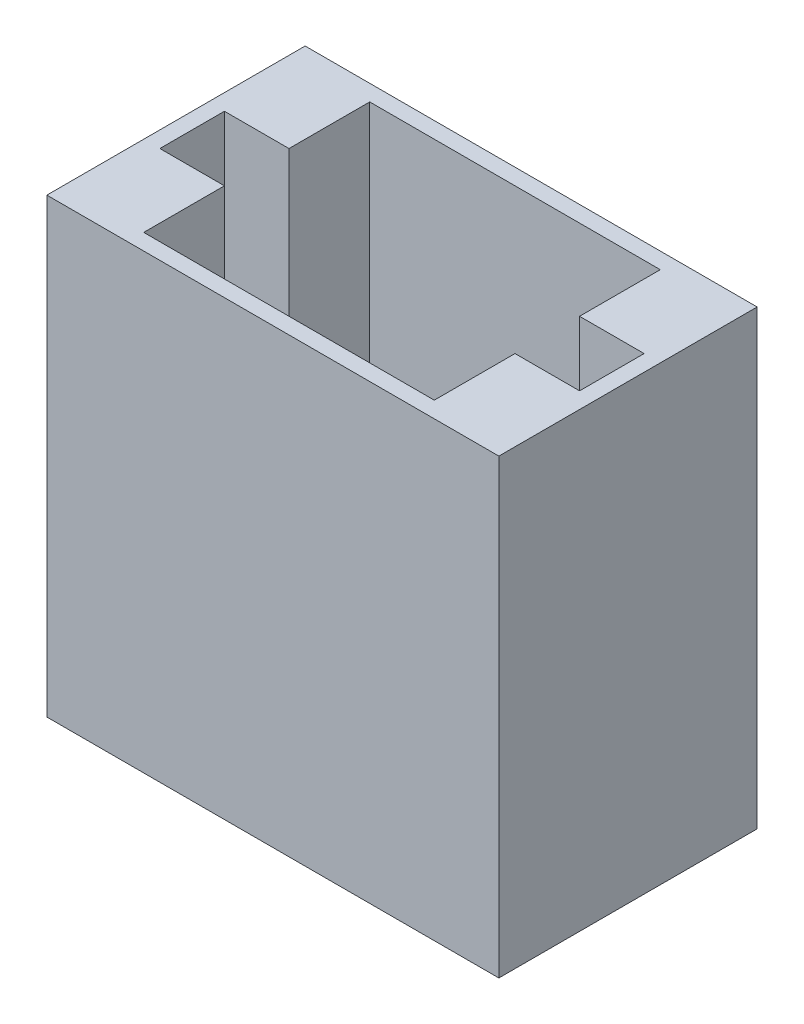
ISO-10303-21;
HEADER;
FILE_DESCRIPTION(('STEP AP214'),'2;1');
FILE_NAME('part.step','',(''),(''),'','','');
FILE_SCHEMA(('AUTOMOTIVE_DESIGN { 1 0 10303 214 1 1 1 1 }'));
ENDSEC;
DATA;
#1=APPLICATION_CONTEXT('core data for automotive mechanical design processes');
#2=APPLICATION_PROTOCOL_DEFINITION('international standard','automotive_design',2000,#1);
#3=PRODUCT_CONTEXT('',#1,'mechanical');
#4=PRODUCT('Part','Part','',(#3));
#5=PRODUCT_RELATED_PRODUCT_CATEGORY('part','',(#4));
#6=PRODUCT_DEFINITION_FORMATION('','',#4);
#7=PRODUCT_DEFINITION_CONTEXT('part definition',#1,'design');
#8=PRODUCT_DEFINITION('design','',#6,#7);
#9=PRODUCT_DEFINITION_SHAPE('','',#8);
#10=(LENGTH_UNIT() NAMED_UNIT(*) SI_UNIT(.MILLI.,.METRE.));
#11=(NAMED_UNIT(*) PLANE_ANGLE_UNIT() SI_UNIT($,.RADIAN.));
#12=(NAMED_UNIT(*) SI_UNIT($,.STERADIAN.) SOLID_ANGLE_UNIT());
#13=UNCERTAINTY_MEASURE_WITH_UNIT(LENGTH_MEASURE(1.E-05),#10,'distance_accuracy_value','');
#14=(GEOMETRIC_REPRESENTATION_CONTEXT(3) GLOBAL_UNCERTAINTY_ASSIGNED_CONTEXT((#13)) GLOBAL_UNIT_ASSIGNED_CONTEXT((#10,
#11,#12)) REPRESENTATION_CONTEXT('',''));
#15=CARTESIAN_POINT('',(0.,0.,0.));
#16=DIRECTION('',(0.,0.,1.));
#17=DIRECTION('',(1.,0.,0.));
#18=AXIS2_PLACEMENT_3D('',#15,#16,#17);
#19=CARTESIAN_POINT('',(32.5,0.,-17.5));
#20=DIRECTION('',(1.,0.,0.));
#21=DIRECTION('',(0.,0.,-1.));
#22=AXIS2_PLACEMENT_3D('',#19,#20,#21);
#23=PLANE('',#22);
#24=DIRECTION('',(0.,0.,-1.));
#25=VECTOR('',#24,1.);
#26=CARTESIAN_POINT('',(32.5,70.,-17.5));
#27=LINE('',#26,#25);
#28=CARTESIAN_POINT('',(32.5,70.,5.));
#29=VERTEX_POINT('',#28);
#30=CARTESIAN_POINT('',(32.5,70.,-5.));
#31=VERTEX_POINT('',#30);
#32=EDGE_CURVE('E182',#29,#31,#27,.T.);
#33=ORIENTED_EDGE('',*,*,#32,.T.);
#34=DIRECTION('',(0.,-1.,0.));
#35=VECTOR('',#34,1.);
#36=CARTESIAN_POINT('',(32.5,0.,-5.));
#37=LINE('',#36,#35);
#38=CARTESIAN_POINT('',(32.5,0.,-5.));
#39=VERTEX_POINT('',#38);
#40=EDGE_CURVE('E438',#31,#39,#37,.T.);
#41=ORIENTED_EDGE('',*,*,#40,.T.);
#42=DIRECTION('',(0.,0.,-1.));
#43=VECTOR('',#42,1.);
#44=CARTESIAN_POINT('',(32.5,0.,-17.5));
#45=LINE('',#44,#43);
#46=CARTESIAN_POINT('',(32.5,0.,5.));
#47=VERTEX_POINT('',#46);
#48=EDGE_CURVE('E171',#47,#39,#45,.T.);
#49=ORIENTED_EDGE('',*,*,#48,.F.);
#50=DIRECTION('',(0.,-1.,0.));
#51=VECTOR('',#50,1.);
#52=CARTESIAN_POINT('',(32.5,0.,5.));
#53=LINE('',#52,#51);
#54=EDGE_CURVE('E445',#29,#47,#53,.T.);
#55=ORIENTED_EDGE('',*,*,#54,.F.);
#56=EDGE_LOOP('',(#33,#41,#49,#55));
#57=FACE_BOUND('',#56,.T.);
#58=ADVANCED_FACE('F35',(#57),#23,.F.);
#59=CARTESIAN_POINT('',(-32.5,0.,-17.5));
#60=DIRECTION('',(-1.,0.,0.));
#61=DIRECTION('',(0.,0.,1.));
#62=AXIS2_PLACEMENT_3D('',#59,#60,#61);
#63=PLANE('',#62);
#64=DIRECTION('',(0.,-1.,0.));
#65=VECTOR('',#64,1.);
#66=CARTESIAN_POINT('',(-32.5,0.,-5.));
#67=LINE('',#66,#65);
#68=CARTESIAN_POINT('',(-32.5,70.,-5.));
#69=VERTEX_POINT('',#68);
#70=CARTESIAN_POINT('',(-32.5,0.,-5.));
#71=VERTEX_POINT('',#70);
#72=EDGE_CURVE('E464',#69,#71,#67,.T.);
#73=ORIENTED_EDGE('',*,*,#72,.F.);
#74=DIRECTION('',(0.,0.,1.));
#75=VECTOR('',#74,1.);
#76=CARTESIAN_POINT('',(-32.5,70.,-17.5));
#77=LINE('',#76,#75);
#78=CARTESIAN_POINT('',(-32.5,70.,5.));
#79=VERTEX_POINT('',#78);
#80=EDGE_CURVE('E188',#69,#79,#77,.T.);
#81=ORIENTED_EDGE('',*,*,#80,.T.);
#82=DIRECTION('',(0.,-1.,0.));
#83=VECTOR('',#82,1.);
#84=CARTESIAN_POINT('',(-32.5,0.,5.));
#85=LINE('',#84,#83);
#86=CARTESIAN_POINT('',(-32.5,0.,5.));
#87=VERTEX_POINT('',#86);
#88=EDGE_CURVE('E479',#79,#87,#85,.T.);
#89=ORIENTED_EDGE('',*,*,#88,.T.);
#90=DIRECTION('',(0.,0.,1.));
#91=VECTOR('',#90,1.);
#92=CARTESIAN_POINT('',(-32.5,0.,-17.5));
#93=LINE('',#92,#91);
#94=EDGE_CURVE('E170',#71,#87,#93,.T.);
#95=ORIENTED_EDGE('',*,*,#94,.F.);
#96=EDGE_LOOP('',(#73,#81,#89,#95));
#97=FACE_BOUND('',#96,.T.);
#98=ADVANCED_FACE('F240',(#97),#63,.F.);
#99=CARTESIAN_POINT('',(35.,70.,20.));
#100=DIRECTION('',(-1.,0.,0.));
#101=DIRECTION('',(0.,0.,1.));
#102=AXIS2_PLACEMENT_3D('',#99,#100,#101);
#103=PLANE('',#102);
#104=DIRECTION('',(0.,0.,-1.));
#105=VECTOR('',#104,1.);
#106=CARTESIAN_POINT('',(35.,0.,20.));
#107=LINE('',#106,#105);
#108=CARTESIAN_POINT('',(35.,0.,20.));
#109=VERTEX_POINT('',#108);
#110=CARTESIAN_POINT('',(35.,0.,-20.));
#111=VERTEX_POINT('',#110);
#112=EDGE_CURVE('E181',#109,#111,#107,.T.);
#113=ORIENTED_EDGE('',*,*,#112,.T.);
#114=DIRECTION('',(0.,-1.,0.));
#115=VECTOR('',#114,1.);
#116=CARTESIAN_POINT('',(35.,70.,-20.));
#117=LINE('',#116,#115);
#118=CARTESIAN_POINT('',(35.,70.,-20.));
#119=VERTEX_POINT('',#118);
#120=EDGE_CURVE('E11',#119,#111,#117,.T.);
#121=ORIENTED_EDGE('',*,*,#120,.F.);
#122=DIRECTION('',(0.,0.,-1.));
#123=VECTOR('',#122,1.);
#124=CARTESIAN_POINT('',(35.,70.,20.));
#125=LINE('',#124,#123);
#126=CARTESIAN_POINT('',(35.,70.,20.));
#127=VERTEX_POINT('',#126);
#128=EDGE_CURVE('E192',#127,#119,#125,.T.);
#129=ORIENTED_EDGE('',*,*,#128,.F.);
#130=DIRECTION('',(0.,-1.,0.));
#131=VECTOR('',#130,1.);
#132=CARTESIAN_POINT('',(35.,70.,20.));
#133=LINE('',#132,#131);
#134=EDGE_CURVE('E202',#127,#109,#133,.T.);
#135=ORIENTED_EDGE('',*,*,#134,.T.);
#136=EDGE_LOOP('',(#113,#121,#129,#135));
#137=FACE_BOUND('',#136,.T.);
#138=ADVANCED_FACE('F37',(#137),#103,.F.);
#139=CARTESIAN_POINT('',(-35.,70.,-20.));
#140=DIRECTION('',(0.,0.,1.));
#141=DIRECTION('',(1.,0.,0.));
#142=AXIS2_PLACEMENT_3D('',#139,#140,#141);
#143=PLANE('',#142);
#144=DIRECTION('',(-1.,0.,0.));
#145=VECTOR('',#144,1.);
#146=CARTESIAN_POINT('',(-35.,0.,-20.));
#147=LINE('',#146,#145);
#148=CARTESIAN_POINT('',(-35.,0.,-20.));
#149=VERTEX_POINT('',#148);
#150=EDGE_CURVE('E205',#111,#149,#147,.T.);
#151=ORIENTED_EDGE('',*,*,#150,.T.);
#152=DIRECTION('',(0.,-1.,0.));
#153=VECTOR('',#152,1.);
#154=CARTESIAN_POINT('',(-35.,70.,-20.));
#155=LINE('',#154,#153);
#156=CARTESIAN_POINT('',(-35.,70.,-20.));
#157=VERTEX_POINT('',#156);
#158=EDGE_CURVE('E43',#157,#149,#155,.T.);
#159=ORIENTED_EDGE('',*,*,#158,.F.);
#160=DIRECTION('',(-1.,0.,0.));
#161=VECTOR('',#160,1.);
#162=CARTESIAN_POINT('',(-35.,70.,-20.));
#163=LINE('',#162,#161);
#164=EDGE_CURVE('E195',#119,#157,#163,.T.);
#165=ORIENTED_EDGE('',*,*,#164,.F.);
#166=ORIENTED_EDGE('',*,*,#120,.T.);
#167=EDGE_LOOP('',(#151,#159,#165,#166));
#168=FACE_BOUND('',#167,.T.);
#169=ADVANCED_FACE('F233',(#168),#143,.F.);
#170=CARTESIAN_POINT('',(-35.,70.,20.));
#171=DIRECTION('',(1.,0.,0.));
#172=DIRECTION('',(0.,0.,-1.));
#173=AXIS2_PLACEMENT_3D('',#170,#171,#172);
#174=PLANE('',#173);
#175=DIRECTION('',(0.,0.,1.));
#176=VECTOR('',#175,1.);
#177=CARTESIAN_POINT('',(-35.,0.,20.));
#178=LINE('',#177,#176);
#179=CARTESIAN_POINT('',(-35.,0.,20.));
#180=VERTEX_POINT('',#179);
#181=EDGE_CURVE('E207',#149,#180,#178,.T.);
#182=ORIENTED_EDGE('',*,*,#181,.T.);
#183=DIRECTION('',(0.,-1.,0.));
#184=VECTOR('',#183,1.);
#185=CARTESIAN_POINT('',(-35.,70.,20.));
#186=LINE('',#185,#184);
#187=CARTESIAN_POINT('',(-35.,70.,20.));
#188=VERTEX_POINT('',#187);
#189=EDGE_CURVE('E212',#188,#180,#186,.T.);
#190=ORIENTED_EDGE('',*,*,#189,.F.);
#191=DIRECTION('',(0.,0.,1.));
#192=VECTOR('',#191,1.);
#193=CARTESIAN_POINT('',(-35.,70.,20.));
#194=LINE('',#193,#192);
#195=EDGE_CURVE('E198',#157,#188,#194,.T.);
#196=ORIENTED_EDGE('',*,*,#195,.F.);
#197=ORIENTED_EDGE('',*,*,#158,.T.);
#198=EDGE_LOOP('',(#182,#190,#196,#197));
#199=FACE_BOUND('',#198,.T.);
#200=ADVANCED_FACE('F219',(#199),#174,.F.);
#201=CARTESIAN_POINT('',(-35.,70.,20.));
#202=DIRECTION('',(0.,0.,-1.));
#203=DIRECTION('',(-1.,0.,0.));
#204=AXIS2_PLACEMENT_3D('',#201,#202,#203);
#205=PLANE('',#204);
#206=DIRECTION('',(1.,0.,0.));
#207=VECTOR('',#206,1.);
#208=CARTESIAN_POINT('',(-35.,0.,20.));
#209=LINE('',#208,#207);
#210=EDGE_CURVE('E196',#180,#109,#209,.T.);
#211=ORIENTED_EDGE('',*,*,#210,.T.);
#212=ORIENTED_EDGE('',*,*,#134,.F.);
#213=DIRECTION('',(1.,0.,0.));
#214=VECTOR('',#213,1.);
#215=CARTESIAN_POINT('',(-35.,70.,20.));
#216=LINE('',#215,#214);
#217=EDGE_CURVE('E200',#188,#127,#216,.T.);
#218=ORIENTED_EDGE('',*,*,#217,.F.);
#219=ORIENTED_EDGE('',*,*,#189,.T.);
#220=EDGE_LOOP('',(#211,#212,#218,#219));
#221=FACE_BOUND('',#220,.T.);
#222=ADVANCED_FACE('F226',(#221),#205,.F.);
#223=CARTESIAN_POINT('',(0.,70.,0.));
#224=DIRECTION('',(0.,-1.,0.));
#225=DIRECTION('',(0.,0.,-1.));
#226=AXIS2_PLACEMENT_3D('',#223,#224,#225);
#227=PLANE('',#226);
#228=DIRECTION('',(1.,0.,0.));
#229=VECTOR('',#228,1.);
#230=CARTESIAN_POINT('',(22.5,70.,-5.));
#231=LINE('',#230,#229);
#232=CARTESIAN_POINT('',(22.5,70.,-5.));
#233=VERTEX_POINT('',#232);
#234=EDGE_CURVE('E439',#233,#31,#231,.T.);
#235=ORIENTED_EDGE('',*,*,#234,.T.);
#236=ORIENTED_EDGE('',*,*,#32,.F.);
#237=DIRECTION('',(1.,0.,0.));
#238=VECTOR('',#237,1.);
#239=CARTESIAN_POINT('',(22.5,70.,5.));
#240=LINE('',#239,#238);
#241=CARTESIAN_POINT('',(22.5,70.,5.));
#242=VERTEX_POINT('',#241);
#243=EDGE_CURVE('E447',#242,#29,#240,.T.);
#244=ORIENTED_EDGE('',*,*,#243,.F.);
#245=DIRECTION('',(0.,0.,1.));
#246=VECTOR('',#245,1.);
#247=CARTESIAN_POINT('',(22.5,70.,0.));
#248=LINE('',#247,#246);
#249=CARTESIAN_POINT('',(22.5,70.,17.5));
#250=VERTEX_POINT('',#249);
#251=EDGE_CURVE('E458',#242,#250,#248,.T.);
#252=ORIENTED_EDGE('',*,*,#251,.T.);
#253=DIRECTION('',(1.,0.,0.));
#254=VECTOR('',#253,1.);
#255=CARTESIAN_POINT('',(-32.5,70.,17.5));
#256=LINE('',#255,#254);
#257=CARTESIAN_POINT('',(-22.5,70.,17.5));
#258=VERTEX_POINT('',#257);
#259=EDGE_CURVE('E175',#258,#250,#256,.T.);
#260=ORIENTED_EDGE('',*,*,#259,.F.);
#261=DIRECTION('',(0.,0.,1.));
#262=VECTOR('',#261,1.);
#263=CARTESIAN_POINT('',(-22.5,70.,0.));
#264=LINE('',#263,#262);
#265=CARTESIAN_POINT('',(-22.5,70.,5.));
#266=VERTEX_POINT('',#265);
#267=EDGE_CURVE('E483',#266,#258,#264,.T.);
#268=ORIENTED_EDGE('',*,*,#267,.F.);
#269=DIRECTION('',(-1.,0.,0.));
#270=VECTOR('',#269,1.);
#271=CARTESIAN_POINT('',(-22.5,70.,5.));
#272=LINE('',#271,#270);
#273=EDGE_CURVE('E186',#266,#79,#272,.T.);
#274=ORIENTED_EDGE('',*,*,#273,.T.);
#275=ORIENTED_EDGE('',*,*,#80,.F.);
#276=DIRECTION('',(-1.,0.,0.));
#277=VECTOR('',#276,1.);
#278=CARTESIAN_POINT('',(-22.5,70.,-5.));
#279=LINE('',#278,#277);
#280=CARTESIAN_POINT('',(-22.5,70.,-5.));
#281=VERTEX_POINT('',#280);
#282=EDGE_CURVE('E477',#281,#69,#279,.T.);
#283=ORIENTED_EDGE('',*,*,#282,.F.);
#284=DIRECTION('',(0.,0.,1.));
#285=VECTOR('',#284,1.);
#286=CARTESIAN_POINT('',(-22.5,70.,0.));
#287=LINE('',#286,#285);
#288=CARTESIAN_POINT('',(-22.5,70.,-17.5));
#289=VERTEX_POINT('',#288);
#290=EDGE_CURVE('E465',#289,#281,#287,.T.);
#291=ORIENTED_EDGE('',*,*,#290,.F.);
#292=DIRECTION('',(-1.,0.,0.));
#293=VECTOR('',#292,1.);
#294=CARTESIAN_POINT('',(-32.5,70.,-17.5));
#295=LINE('',#294,#293);
#296=CARTESIAN_POINT('',(22.5,70.,-17.5));
#297=VERTEX_POINT('',#296);
#298=EDGE_CURVE('E185',#297,#289,#295,.T.);
#299=ORIENTED_EDGE('',*,*,#298,.F.);
#300=DIRECTION('',(0.,0.,1.));
#301=VECTOR('',#300,1.);
#302=CARTESIAN_POINT('',(22.5,70.,0.));
#303=LINE('',#302,#301);
#304=EDGE_CURVE('E50',#297,#233,#303,.T.);
#305=ORIENTED_EDGE('',*,*,#304,.T.);
#306=EDGE_LOOP('',(#235,#236,#244,#252,#260,#268,#274,#275,#283,#291,#299,#305));
#307=FACE_BOUND('',#306,.T.);
#308=ORIENTED_EDGE('',*,*,#128,.T.);
#309=ORIENTED_EDGE('',*,*,#164,.T.);
#310=ORIENTED_EDGE('',*,*,#195,.T.);
#311=ORIENTED_EDGE('',*,*,#217,.T.);
#312=EDGE_LOOP('',(#308,#309,#310,#311));
#313=FACE_BOUND('',#312,.T.);
#314=ADVANCED_FACE('F232',(#307,#313),#227,.F.);
#315=CARTESIAN_POINT('',(0.,0.,0.));
#316=DIRECTION('',(0.,-1.,0.));
#317=DIRECTION('',(0.,0.,-1.));
#318=AXIS2_PLACEMENT_3D('',#315,#316,#317);
#319=PLANE('',#318);
#320=DIRECTION('',(1.,0.,0.));
#321=VECTOR('',#320,1.);
#322=CARTESIAN_POINT('',(22.5,0.,5.));
#323=LINE('',#322,#321);
#324=CARTESIAN_POINT('',(22.5,0.,5.));
#325=VERTEX_POINT('',#324);
#326=EDGE_CURVE('E462',#325,#47,#323,.T.);
#327=ORIENTED_EDGE('',*,*,#326,.T.);
#328=ORIENTED_EDGE('',*,*,#48,.T.);
#329=DIRECTION('',(1.,0.,0.));
#330=VECTOR('',#329,1.);
#331=CARTESIAN_POINT('',(22.5,0.,-5.));
#332=LINE('',#331,#330);
#333=CARTESIAN_POINT('',(22.5,0.,-5.));
#334=VERTEX_POINT('',#333);
#335=EDGE_CURVE('E163',#334,#39,#332,.T.);
#336=ORIENTED_EDGE('',*,*,#335,.F.);
#337=DIRECTION('',(0.,0.,-1.));
#338=VECTOR('',#337,1.);
#339=CARTESIAN_POINT('',(22.5,0.,0.));
#340=LINE('',#339,#338);
#341=CARTESIAN_POINT('',(22.5,0.,-17.5));
#342=VERTEX_POINT('',#341);
#343=EDGE_CURVE('E150',#334,#342,#340,.T.);
#344=ORIENTED_EDGE('',*,*,#343,.T.);
#345=DIRECTION('',(-1.,0.,0.));
#346=VECTOR('',#345,1.);
#347=CARTESIAN_POINT('',(-32.5,0.,-17.5));
#348=LINE('',#347,#346);
#349=CARTESIAN_POINT('',(-22.5,0.,-17.5));
#350=VERTEX_POINT('',#349);
#351=EDGE_CURVE('E160',#342,#350,#348,.T.);
#352=ORIENTED_EDGE('',*,*,#351,.T.);
#353=DIRECTION('',(0.,0.,-1.));
#354=VECTOR('',#353,1.);
#355=CARTESIAN_POINT('',(-22.5,0.,0.));
#356=LINE('',#355,#354);
#357=CARTESIAN_POINT('',(-22.5,0.,-5.));
#358=VERTEX_POINT('',#357);
#359=EDGE_CURVE('E470',#358,#350,#356,.T.);
#360=ORIENTED_EDGE('',*,*,#359,.F.);
#361=DIRECTION('',(-1.,0.,0.));
#362=VECTOR('',#361,1.);
#363=CARTESIAN_POINT('',(-22.5,0.,-5.));
#364=LINE('',#363,#362);
#365=EDGE_CURVE('E473',#358,#71,#364,.T.);
#366=ORIENTED_EDGE('',*,*,#365,.T.);
#367=ORIENTED_EDGE('',*,*,#94,.T.);
#368=DIRECTION('',(-1.,0.,0.));
#369=VECTOR('',#368,1.);
#370=CARTESIAN_POINT('',(-22.5,0.,5.));
#371=LINE('',#370,#369);
#372=CARTESIAN_POINT('',(-22.5,0.,5.));
#373=VERTEX_POINT('',#372);
#374=EDGE_CURVE('E489',#373,#87,#371,.T.);
#375=ORIENTED_EDGE('',*,*,#374,.F.);
#376=DIRECTION('',(0.,0.,-1.));
#377=VECTOR('',#376,1.);
#378=CARTESIAN_POINT('',(-22.5,0.,0.));
#379=LINE('',#378,#377);
#380=CARTESIAN_POINT('',(-22.5,0.,17.5));
#381=VERTEX_POINT('',#380);
#382=EDGE_CURVE('E487',#381,#373,#379,.T.);
#383=ORIENTED_EDGE('',*,*,#382,.F.);
#384=DIRECTION('',(1.,0.,0.));
#385=VECTOR('',#384,1.);
#386=CARTESIAN_POINT('',(-32.5,0.,17.5));
#387=LINE('',#386,#385);
#388=CARTESIAN_POINT('',(22.5,0.,17.5));
#389=VERTEX_POINT('',#388);
#390=EDGE_CURVE('E173',#381,#389,#387,.T.);
#391=ORIENTED_EDGE('',*,*,#390,.T.);
#392=DIRECTION('',(0.,0.,-1.));
#393=VECTOR('',#392,1.);
#394=CARTESIAN_POINT('',(22.5,0.,0.));
#395=LINE('',#394,#393);
#396=EDGE_CURVE('E58',#389,#325,#395,.T.);
#397=ORIENTED_EDGE('',*,*,#396,.T.);
#398=EDGE_LOOP('',(#327,#328,#336,#344,#352,#360,#366,#367,#375,#383,#391,#397));
#399=FACE_BOUND('',#398,.T.);
#400=ORIENTED_EDGE('',*,*,#112,.F.);
#401=ORIENTED_EDGE('',*,*,#210,.F.);
#402=ORIENTED_EDGE('',*,*,#181,.F.);
#403=ORIENTED_EDGE('',*,*,#150,.F.);
#404=EDGE_LOOP('',(#400,#401,#402,#403));
#405=FACE_BOUND('',#404,.T.);
#406=ADVANCED_FACE('F157',(#399,#405),#319,.T.);
#407=CARTESIAN_POINT('',(-32.5,0.,17.5));
#408=DIRECTION('',(0.,0.,1.));
#409=DIRECTION('',(1.,0.,0.));
#410=AXIS2_PLACEMENT_3D('',#407,#408,#409);
#411=PLANE('',#410);
#412=ORIENTED_EDGE('',*,*,#259,.T.);
#413=DIRECTION('',(0.,-1.,0.));
#414=VECTOR('',#413,1.);
#415=CARTESIAN_POINT('',(22.5,0.,17.5));
#416=LINE('',#415,#414);
#417=EDGE_CURVE('E456',#250,#389,#416,.T.);
#418=ORIENTED_EDGE('',*,*,#417,.T.);
#419=ORIENTED_EDGE('',*,*,#390,.F.);
#420=DIRECTION('',(0.,-1.,0.));
#421=VECTOR('',#420,1.);
#422=CARTESIAN_POINT('',(-22.5,0.,17.5));
#423=LINE('',#422,#421);
#424=EDGE_CURVE('E485',#258,#381,#423,.T.);
#425=ORIENTED_EDGE('',*,*,#424,.F.);
#426=EDGE_LOOP('',(#412,#418,#419,#425));
#427=FACE_BOUND('',#426,.T.);
#428=ADVANCED_FACE('F258',(#427),#411,.F.);
#429=CARTESIAN_POINT('',(-32.5,0.,-17.5));
#430=DIRECTION('',(0.,0.,-1.));
#431=DIRECTION('',(-1.,0.,0.));
#432=AXIS2_PLACEMENT_3D('',#429,#430,#431);
#433=PLANE('',#432);
#434=ORIENTED_EDGE('',*,*,#351,.F.);
#435=DIRECTION('',(0.,1.,0.));
#436=VECTOR('',#435,1.);
#437=CARTESIAN_POINT('',(22.5,0.,-17.5));
#438=LINE('',#437,#436);
#439=EDGE_CURVE('E147',#342,#297,#438,.T.);
#440=ORIENTED_EDGE('',*,*,#439,.T.);
#441=ORIENTED_EDGE('',*,*,#298,.T.);
#442=DIRECTION('',(0.,1.,0.));
#443=VECTOR('',#442,1.);
#444=CARTESIAN_POINT('',(-22.5,0.,-17.5));
#445=LINE('',#444,#443);
#446=EDGE_CURVE('E169',#350,#289,#445,.T.);
#447=ORIENTED_EDGE('',*,*,#446,.F.);
#448=EDGE_LOOP('',(#434,#440,#441,#447));
#449=FACE_BOUND('',#448,.T.);
#450=ADVANCED_FACE('F167',(#449),#433,.F.);
#451=CARTESIAN_POINT('',(-22.5,0.,4.99999999999999));
#452=DIRECTION('',(0.,0.,-1.));
#453=DIRECTION('',(-1.,0.,0.));
#454=AXIS2_PLACEMENT_3D('',#451,#452,#453);
#455=PLANE('',#454);
#456=ORIENTED_EDGE('',*,*,#88,.F.);
#457=ORIENTED_EDGE('',*,*,#273,.F.);
#458=DIRECTION('',(0.,-1.,0.));
#459=VECTOR('',#458,1.);
#460=CARTESIAN_POINT('',(-22.5,0.,4.99999999999999));
#461=LINE('',#460,#459);
#462=EDGE_CURVE('E480',#266,#373,#461,.T.);
#463=ORIENTED_EDGE('',*,*,#462,.T.);
#464=ORIENTED_EDGE('',*,*,#374,.T.);
#465=EDGE_LOOP('',(#456,#457,#463,#464));
#466=FACE_BOUND('',#465,.T.);
#467=ADVANCED_FACE('F282',(#466),#455,.T.);
#468=CARTESIAN_POINT('',(-22.5,0.,0.));
#469=DIRECTION('',(1.,0.,0.));
#470=DIRECTION('',(0.,0.,-1.));
#471=AXIS2_PLACEMENT_3D('',#468,#469,#470);
#472=PLANE('',#471);
#473=ORIENTED_EDGE('',*,*,#462,.F.);
#474=ORIENTED_EDGE('',*,*,#267,.T.);
#475=ORIENTED_EDGE('',*,*,#424,.T.);
#476=ORIENTED_EDGE('',*,*,#382,.T.);
#477=EDGE_LOOP('',(#473,#474,#475,#476));
#478=FACE_BOUND('',#477,.T.);
#479=ADVANCED_FACE('F308',(#478),#472,.T.);
#480=CARTESIAN_POINT('',(-22.5,0.,-5.00000000000001));
#481=DIRECTION('',(0.,0.,-1.));
#482=DIRECTION('',(-1.,0.,0.));
#483=AXIS2_PLACEMENT_3D('',#480,#481,#482);
#484=PLANE('',#483);
#485=ORIENTED_EDGE('',*,*,#72,.T.);
#486=ORIENTED_EDGE('',*,*,#365,.F.);
#487=DIRECTION('',(0.,-1.,0.));
#488=VECTOR('',#487,1.);
#489=CARTESIAN_POINT('',(-22.5,0.,-5.00000000000001));
#490=LINE('',#489,#488);
#491=EDGE_CURVE('E468',#281,#358,#490,.T.);
#492=ORIENTED_EDGE('',*,*,#491,.F.);
#493=ORIENTED_EDGE('',*,*,#282,.T.);
#494=EDGE_LOOP('',(#485,#486,#492,#493));
#495=FACE_BOUND('',#494,.T.);
#496=ADVANCED_FACE('F316',(#495),#484,.F.);
#497=CARTESIAN_POINT('',(-22.5,0.,0.));
#498=DIRECTION('',(1.,0.,0.));
#499=DIRECTION('',(0.,0.,-1.));
#500=AXIS2_PLACEMENT_3D('',#497,#498,#499);
#501=PLANE('',#500);
#502=ORIENTED_EDGE('',*,*,#290,.T.);
#503=ORIENTED_EDGE('',*,*,#491,.T.);
#504=ORIENTED_EDGE('',*,*,#359,.T.);
#505=ORIENTED_EDGE('',*,*,#446,.T.);
#506=EDGE_LOOP('',(#502,#503,#504,#505));
#507=FACE_BOUND('',#506,.T.);
#508=ADVANCED_FACE('F324',(#507),#501,.T.);
#509=CARTESIAN_POINT('',(22.5,0.,4.99999999999999));
#510=DIRECTION('',(0.,0.,1.));
#511=DIRECTION('',(1.,0.,0.));
#512=AXIS2_PLACEMENT_3D('',#509,#510,#511);
#513=PLANE('',#512);
#514=ORIENTED_EDGE('',*,*,#54,.T.);
#515=ORIENTED_EDGE('',*,*,#326,.F.);
#516=DIRECTION('',(0.,-1.,0.));
#517=VECTOR('',#516,1.);
#518=CARTESIAN_POINT('',(22.5,0.,4.99999999999999));
#519=LINE('',#518,#517);
#520=EDGE_CURVE('E453',#242,#325,#519,.T.);
#521=ORIENTED_EDGE('',*,*,#520,.F.);
#522=ORIENTED_EDGE('',*,*,#243,.T.);
#523=EDGE_LOOP('',(#514,#515,#521,#522));
#524=FACE_BOUND('',#523,.T.);
#525=ADVANCED_FACE('F331',(#524),#513,.F.);
#526=CARTESIAN_POINT('',(22.5,0.,0.));
#527=DIRECTION('',(-1.,0.,0.));
#528=DIRECTION('',(0.,0.,-1.));
#529=AXIS2_PLACEMENT_3D('',#526,#527,#528);
#530=PLANE('',#529);
#531=ORIENTED_EDGE('',*,*,#520,.T.);
#532=ORIENTED_EDGE('',*,*,#396,.F.);
#533=ORIENTED_EDGE('',*,*,#417,.F.);
#534=ORIENTED_EDGE('',*,*,#251,.F.);
#535=EDGE_LOOP('',(#531,#532,#533,#534));
#536=FACE_BOUND('',#535,.T.);
#537=ADVANCED_FACE('F337',(#536),#530,.T.);
#538=CARTESIAN_POINT('',(22.5,0.,-5.00000000000001));
#539=DIRECTION('',(0.,0.,1.));
#540=DIRECTION('',(1.,0.,0.));
#541=AXIS2_PLACEMENT_3D('',#538,#539,#540);
#542=PLANE('',#541);
#543=ORIENTED_EDGE('',*,*,#40,.F.);
#544=ORIENTED_EDGE('',*,*,#234,.F.);
#545=DIRECTION('',(0.,-1.,0.));
#546=VECTOR('',#545,1.);
#547=CARTESIAN_POINT('',(22.5,0.,-5.00000000000001));
#548=LINE('',#547,#546);
#549=EDGE_CURVE('E164',#233,#334,#548,.T.);
#550=ORIENTED_EDGE('',*,*,#549,.T.);
#551=ORIENTED_EDGE('',*,*,#335,.T.);
#552=EDGE_LOOP('',(#543,#544,#550,#551));
#553=FACE_BOUND('',#552,.T.);
#554=ADVANCED_FACE('F345',(#553),#542,.T.);
#555=CARTESIAN_POINT('',(22.5,0.,0.));
#556=DIRECTION('',(-1.,0.,0.));
#557=DIRECTION('',(0.,0.,-1.));
#558=AXIS2_PLACEMENT_3D('',#555,#556,#557);
#559=PLANE('',#558);
#560=ORIENTED_EDGE('',*,*,#304,.F.);
#561=ORIENTED_EDGE('',*,*,#439,.F.);
#562=ORIENTED_EDGE('',*,*,#343,.F.);
#563=ORIENTED_EDGE('',*,*,#549,.F.);
#564=EDGE_LOOP('',(#560,#561,#562,#563));
#565=FACE_BOUND('',#564,.T.);
#566=ADVANCED_FACE('F149',(#565),#559,.T.);
#567=CLOSED_SHELL('',(#58,#98,#138,#169,#200,#222,#314,#406,#428,#450,#467,#479,#496,#508,#525,
#537,#554,#566));
#568=MANIFOLD_SOLID_BREP('B2',#567);
#569=ADVANCED_BREP_SHAPE_REPRESENTATION('',(#18,#568),#14);
#570=SHAPE_DEFINITION_REPRESENTATION(#9,#569);
ENDSEC;
END-ISO-10303-21;
